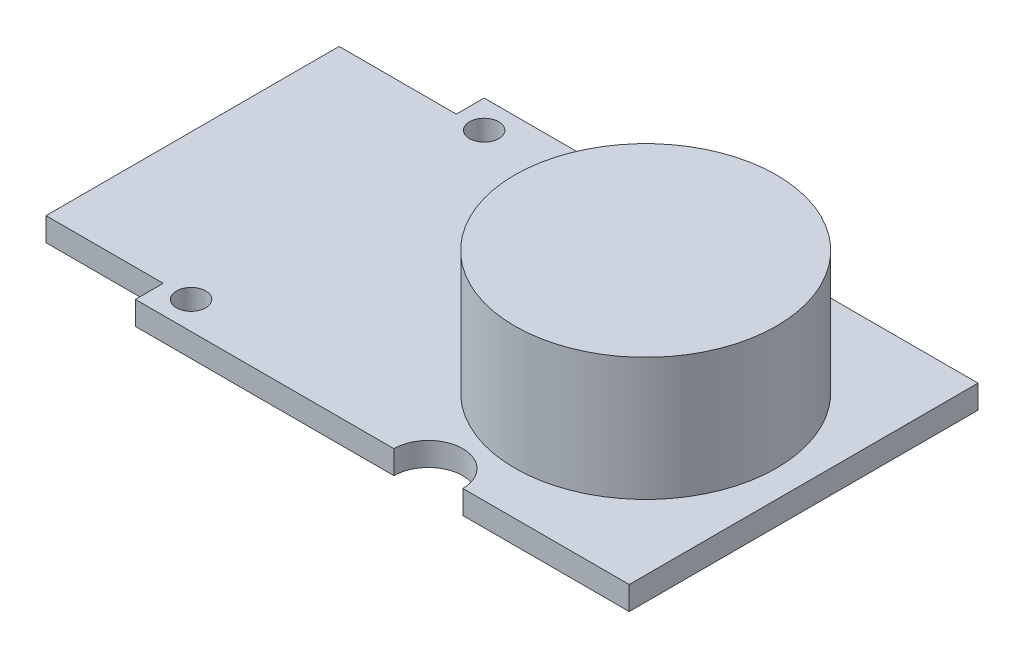
ISO-10303-21;
HEADER;
FILE_DESCRIPTION(('STEP AP214'),'2;1');
FILE_NAME('part.step','',(''),(''),'','','');
FILE_SCHEMA(('AUTOMOTIVE_DESIGN { 1 0 10303 214 1 1 1 1 }'));
ENDSEC;
DATA;
#1=APPLICATION_CONTEXT('core data for automotive mechanical design processes');
#2=APPLICATION_PROTOCOL_DEFINITION('international standard','automotive_design',2000,#1);
#3=PRODUCT_CONTEXT('',#1,'mechanical');
#4=PRODUCT('Part','Part','',(#3));
#5=PRODUCT_RELATED_PRODUCT_CATEGORY('part','',(#4));
#6=PRODUCT_DEFINITION_FORMATION('','',#4);
#7=PRODUCT_DEFINITION_CONTEXT('part definition',#1,'design');
#8=PRODUCT_DEFINITION('design','',#6,#7);
#9=PRODUCT_DEFINITION_SHAPE('','',#8);
#10=(LENGTH_UNIT() NAMED_UNIT(*) SI_UNIT(.MILLI.,.METRE.));
#11=(NAMED_UNIT(*) PLANE_ANGLE_UNIT() SI_UNIT($,.RADIAN.));
#12=(NAMED_UNIT(*) SI_UNIT($,.STERADIAN.) SOLID_ANGLE_UNIT());
#13=UNCERTAINTY_MEASURE_WITH_UNIT(LENGTH_MEASURE(1.E-05),#10,'distance_accuracy_value','');
#14=(GEOMETRIC_REPRESENTATION_CONTEXT(3) GLOBAL_UNCERTAINTY_ASSIGNED_CONTEXT((#13)) GLOBAL_UNIT_ASSIGNED_CONTEXT((#10,
#11,#12)) REPRESENTATION_CONTEXT('',''));
#15=CARTESIAN_POINT('',(0.,0.,0.));
#16=DIRECTION('',(0.,0.,1.));
#17=DIRECTION('',(1.,0.,0.));
#18=AXIS2_PLACEMENT_3D('',#15,#16,#17);
#19=CARTESIAN_POINT('',(0.,1.6,-11.9));
#20=DIRECTION('',(0.,0.,-1.));
#21=DIRECTION('',(-1.,0.,0.));
#22=AXIS2_PLACEMENT_3D('',#19,#20,#21);
#23=PLANE('',#22);
#24=DIRECTION('',(0.,1.,0.));
#25=VECTOR('',#24,1.);
#26=CARTESIAN_POINT('',(-22.9202394445578,0.,-11.9));
#27=LINE('',#26,#25);
#28=CARTESIAN_POINT('',(-22.9202394445578,0.,-11.9));
#29=VERTEX_POINT('',#28);
#30=CARTESIAN_POINT('',(-22.9202394445578,1.6,-11.9));
#31=VERTEX_POINT('',#30);
#32=EDGE_CURVE('E241',#29,#31,#27,.T.);
#33=ORIENTED_EDGE('',*,*,#32,.T.);
#34=DIRECTION('',(1.,0.,0.));
#35=VECTOR('',#34,1.);
#36=CARTESIAN_POINT('',(0.,1.6,-11.9));
#37=LINE('',#36,#35);
#38=CARTESIAN_POINT('',(-5.28010717467876,1.6,-11.9));
#39=VERTEX_POINT('',#38);
#40=EDGE_CURVE('E191',#31,#39,#37,.T.);
#41=ORIENTED_EDGE('',*,*,#40,.T.);
#42=DIRECTION('',(0.,-1.,0.));
#43=VECTOR('',#42,1.);
#44=CARTESIAN_POINT('',(-5.28010717467876,1.6,-11.9));
#45=LINE('',#44,#43);
#46=CARTESIAN_POINT('',(-5.28010717467876,0.,-11.9));
#47=VERTEX_POINT('',#46);
#48=EDGE_CURVE('E192',#39,#47,#45,.T.);
#49=ORIENTED_EDGE('',*,*,#48,.T.);
#50=DIRECTION('',(1.,0.,0.));
#51=VECTOR('',#50,1.);
#52=CARTESIAN_POINT('',(0.,0.,-11.9));
#53=LINE('',#52,#51);
#54=EDGE_CURVE('E160',#29,#47,#53,.T.);
#55=ORIENTED_EDGE('',*,*,#54,.F.);
#56=EDGE_LOOP('',(#33,#41,#49,#55));
#57=FACE_BOUND('',#56,.T.);
#58=ADVANCED_FACE('F44',(#57),#23,.T.);
#59=CARTESIAN_POINT('',(-30.9202394445578,1.6,0.));
#60=DIRECTION('',(1.,0.,0.));
#61=DIRECTION('',(0.,0.,-1.));
#62=AXIS2_PLACEMENT_3D('',#59,#60,#61);
#63=PLANE('',#62);
#64=DIRECTION('',(0.,0.,1.));
#65=VECTOR('',#64,1.);
#66=CARTESIAN_POINT('',(-30.9202394445578,1.6,0.));
#67=LINE('',#66,#65);
#68=CARTESIAN_POINT('',(-30.9202394445578,1.6,-10.));
#69=VERTEX_POINT('',#68);
#70=CARTESIAN_POINT('',(-30.9202394445578,1.6,10.));
#71=VERTEX_POINT('',#70);
#72=EDGE_CURVE('E152',#69,#71,#67,.T.);
#73=ORIENTED_EDGE('',*,*,#72,.F.);
#74=DIRECTION('',(0.,1.,0.));
#75=VECTOR('',#74,1.);
#76=CARTESIAN_POINT('',(-30.9202394445578,0.,-10.));
#77=LINE('',#76,#75);
#78=CARTESIAN_POINT('',(-30.9202394445578,0.,-10.));
#79=VERTEX_POINT('',#78);
#80=EDGE_CURVE('E138',#79,#69,#77,.T.);
#81=ORIENTED_EDGE('',*,*,#80,.F.);
#82=DIRECTION('',(0.,0.,1.));
#83=VECTOR('',#82,1.);
#84=CARTESIAN_POINT('',(-30.9202394445578,0.,0.));
#85=LINE('',#84,#83);
#86=CARTESIAN_POINT('',(-30.9202394445578,0.,10.));
#87=VERTEX_POINT('',#86);
#88=EDGE_CURVE('E150',#79,#87,#85,.T.);
#89=ORIENTED_EDGE('',*,*,#88,.T.);
#90=DIRECTION('',(0.,1.,0.));
#91=VECTOR('',#90,1.);
#92=CARTESIAN_POINT('',(-30.9202394445578,0.,10.));
#93=LINE('',#92,#91);
#94=EDGE_CURVE('E341',#87,#71,#93,.T.);
#95=ORIENTED_EDGE('',*,*,#94,.T.);
#96=EDGE_LOOP('',(#73,#81,#89,#95));
#97=FACE_BOUND('',#96,.T.);
#98=ADVANCED_FACE('F46',(#97),#63,.F.);
#99=CARTESIAN_POINT('',(0.,1.6,11.9));
#100=DIRECTION('',(0.,0.,-1.));
#101=DIRECTION('',(-1.,0.,0.));
#102=AXIS2_PLACEMENT_3D('',#99,#100,#101);
#103=PLANE('',#102);
#104=DIRECTION('',(1.,0.,0.));
#105=VECTOR('',#104,1.);
#106=CARTESIAN_POINT('',(0.,1.6,11.9));
#107=LINE('',#106,#105);
#108=CARTESIAN_POINT('',(-22.9202394445578,1.6,11.9));
#109=VERTEX_POINT('',#108);
#110=CARTESIAN_POINT('',(-5.28010717467876,1.6,11.9));
#111=VERTEX_POINT('',#110);
#112=EDGE_CURVE('E228',#109,#111,#107,.T.);
#113=ORIENTED_EDGE('',*,*,#112,.F.);
#114=DIRECTION('',(0.,1.,0.));
#115=VECTOR('',#114,1.);
#116=CARTESIAN_POINT('',(-22.9202394445578,0.,11.9));
#117=LINE('',#116,#115);
#118=CARTESIAN_POINT('',(-22.9202394445578,0.,11.9));
#119=VERTEX_POINT('',#118);
#120=EDGE_CURVE('E229',#119,#109,#117,.T.);
#121=ORIENTED_EDGE('',*,*,#120,.F.);
#122=DIRECTION('',(1.,0.,0.));
#123=VECTOR('',#122,1.);
#124=CARTESIAN_POINT('',(0.,0.,11.9));
#125=LINE('',#124,#123);
#126=CARTESIAN_POINT('',(-5.28010717467876,0.,11.9));
#127=VERTEX_POINT('',#126);
#128=EDGE_CURVE('E159',#119,#127,#125,.T.);
#129=ORIENTED_EDGE('',*,*,#128,.T.);
#130=DIRECTION('',(0.,-1.,0.));
#131=VECTOR('',#130,1.);
#132=CARTESIAN_POINT('',(-5.28010717467876,1.6,11.9));
#133=LINE('',#132,#131);
#134=EDGE_CURVE('E11',#111,#127,#133,.T.);
#135=ORIENTED_EDGE('',*,*,#134,.F.);
#136=EDGE_LOOP('',(#113,#121,#129,#135));
#137=FACE_BOUND('',#136,.T.);
#138=ADVANCED_FACE('F226',(#137),#103,.F.);
#139=CARTESIAN_POINT('',(-2.93010717467876,1.6,11.9));
#140=DIRECTION('',(0.,-1.,0.));
#141=DIRECTION('',(0.,0.,-1.));
#142=AXIS2_PLACEMENT_3D('',#139,#140,#141);
#143=CYLINDRICAL_SURFACE('',#142,2.35);
#144=CARTESIAN_POINT('',(-2.93010717467876,0.,11.9));
#145=DIRECTION('',(0.,1.,0.));
#146=DIRECTION('',(0.,0.,1.));
#147=AXIS2_PLACEMENT_3D('',#144,#145,#146);
#148=CIRCLE('',#147,2.35);
#149=CARTESIAN_POINT('',(-0.580107174678759,0.,11.9));
#150=VERTEX_POINT('',#149);
#151=EDGE_CURVE('E164',#150,#127,#148,.T.);
#152=ORIENTED_EDGE('',*,*,#151,.F.);
#153=DIRECTION('',(0.,-1.,0.));
#154=VECTOR('',#153,1.);
#155=CARTESIAN_POINT('',(-0.580107174678759,1.6,11.9));
#156=LINE('',#155,#154);
#157=CARTESIAN_POINT('',(-0.580107174678759,1.6,11.9));
#158=VERTEX_POINT('',#157);
#159=EDGE_CURVE('E53',#158,#150,#156,.T.);
#160=ORIENTED_EDGE('',*,*,#159,.F.);
#161=CARTESIAN_POINT('',(-2.93010717467876,1.6,11.9));
#162=DIRECTION('',(0.,1.,0.));
#163=DIRECTION('',(0.,0.,1.));
#164=AXIS2_PLACEMENT_3D('',#161,#162,#163);
#165=CIRCLE('',#164,2.35);
#166=EDGE_CURVE('E223',#158,#111,#165,.T.);
#167=ORIENTED_EDGE('',*,*,#166,.T.);
#168=ORIENTED_EDGE('',*,*,#134,.T.);
#169=EDGE_LOOP('',(#152,#160,#167,#168));
#170=FACE_BOUND('',#169,.T.);
#171=ADVANCED_FACE('F221',(#170),#143,.F.);
#172=CARTESIAN_POINT('',(10.7797605554422,0.,11.9));
#173=VERTEX_POINT('',#172);
#174=EDGE_CURVE('E166',#150,#173,#125,.T.);
#175=ORIENTED_EDGE('',*,*,#174,.T.);
#176=DIRECTION('',(0.,-1.,0.));
#177=VECTOR('',#176,1.);
#178=CARTESIAN_POINT('',(10.7797605554422,1.6,11.9));
#179=LINE('',#178,#177);
#180=CARTESIAN_POINT('',(10.7797605554422,1.6,11.9));
#181=VERTEX_POINT('',#180);
#182=EDGE_CURVE('E203',#181,#173,#179,.T.);
#183=ORIENTED_EDGE('',*,*,#182,.F.);
#184=EDGE_CURVE('E212',#158,#181,#107,.T.);
#185=ORIENTED_EDGE('',*,*,#184,.F.);
#186=ORIENTED_EDGE('',*,*,#159,.T.);
#187=EDGE_LOOP('',(#175,#183,#185,#186));
#188=FACE_BOUND('',#187,.T.);
#189=ADVANCED_FACE('F210',(#188),#103,.F.);
#190=CARTESIAN_POINT('',(10.7797605554422,1.6,0.));
#191=DIRECTION('',(1.,0.,0.));
#192=DIRECTION('',(0.,0.,-1.));
#193=AXIS2_PLACEMENT_3D('',#190,#191,#192);
#194=PLANE('',#193);
#195=DIRECTION('',(0.,0.,1.));
#196=VECTOR('',#195,1.);
#197=CARTESIAN_POINT('',(10.7797605554422,0.,0.));
#198=LINE('',#197,#196);
#199=CARTESIAN_POINT('',(10.7797605554422,0.,-11.9));
#200=VERTEX_POINT('',#199);
#201=EDGE_CURVE('E175',#200,#173,#198,.T.);
#202=ORIENTED_EDGE('',*,*,#201,.F.);
#203=DIRECTION('',(0.,-1.,0.));
#204=VECTOR('',#203,1.);
#205=CARTESIAN_POINT('',(10.7797605554422,1.6,-11.9));
#206=LINE('',#205,#204);
#207=CARTESIAN_POINT('',(10.7797605554422,1.6,-11.9));
#208=VERTEX_POINT('',#207);
#209=EDGE_CURVE('E200',#208,#200,#206,.T.);
#210=ORIENTED_EDGE('',*,*,#209,.F.);
#211=DIRECTION('',(0.,0.,1.));
#212=VECTOR('',#211,1.);
#213=CARTESIAN_POINT('',(10.7797605554422,1.6,0.));
#214=LINE('',#213,#212);
#215=EDGE_CURVE('E266',#208,#181,#214,.T.);
#216=ORIENTED_EDGE('',*,*,#215,.T.);
#217=ORIENTED_EDGE('',*,*,#182,.T.);
#218=EDGE_LOOP('',(#202,#210,#216,#217));
#219=FACE_BOUND('',#218,.T.);
#220=ADVANCED_FACE('F313',(#219),#194,.T.);
#221=CARTESIAN_POINT('',(-0.580107174678759,0.,-11.9));
#222=VERTEX_POINT('',#221);
#223=EDGE_CURVE('E169',#222,#200,#53,.T.);
#224=ORIENTED_EDGE('',*,*,#223,.F.);
#225=DIRECTION('',(0.,-1.,0.));
#226=VECTOR('',#225,1.);
#227=CARTESIAN_POINT('',(-0.580107174678759,1.6,-11.9));
#228=LINE('',#227,#226);
#229=CARTESIAN_POINT('',(-0.580107174678759,1.6,-11.9));
#230=VERTEX_POINT('',#229);
#231=EDGE_CURVE('E196',#230,#222,#228,.T.);
#232=ORIENTED_EDGE('',*,*,#231,.F.);
#233=EDGE_CURVE('E259',#230,#208,#37,.T.);
#234=ORIENTED_EDGE('',*,*,#233,.T.);
#235=ORIENTED_EDGE('',*,*,#209,.T.);
#236=EDGE_LOOP('',(#224,#232,#234,#235));
#237=FACE_BOUND('',#236,.T.);
#238=ADVANCED_FACE('F303',(#237),#23,.T.);
#239=CARTESIAN_POINT('',(-21.0202394445578,1.6,10.));
#240=DIRECTION('',(0.,-1.,0.));
#241=DIRECTION('',(0.,0.,-1.));
#242=AXIS2_PLACEMENT_3D('',#239,#240,#241);
#243=CYLINDRICAL_SURFACE('',#242,1.);
#244=CARTESIAN_POINT('',(-21.0202394445578,1.6,10.));
#245=DIRECTION('',(0.,1.,0.));
#246=DIRECTION('',(0.,0.,1.));
#247=AXIS2_PLACEMENT_3D('',#244,#245,#246);
#248=CIRCLE('',#247,1.);
#249=CARTESIAN_POINT('',(-21.0202394445578,1.6,11.));
#250=VERTEX_POINT('',#249);
#251=EDGE_CURVE('E274',#250,#250,#248,.T.);
#252=ORIENTED_EDGE('',*,*,#251,.T.);
#253=EDGE_LOOP('',(#252));
#254=FACE_BOUND('',#253,.T.);
#255=CARTESIAN_POINT('',(-21.0202394445578,0.,10.));
#256=DIRECTION('',(0.,1.,0.));
#257=DIRECTION('',(0.,0.,1.));
#258=AXIS2_PLACEMENT_3D('',#255,#256,#257);
#259=CIRCLE('',#258,1.);
#260=CARTESIAN_POINT('',(-21.0202394445578,0.,11.));
#261=VERTEX_POINT('',#260);
#262=EDGE_CURVE('E183',#261,#261,#259,.T.);
#263=ORIENTED_EDGE('',*,*,#262,.F.);
#264=EDGE_LOOP('',(#263));
#265=FACE_BOUND('',#264,.T.);
#266=ADVANCED_FACE('F312',(#254,#265),#243,.F.);
#267=CARTESIAN_POINT('',(-2.93010717467876,1.6,-11.9));
#268=DIRECTION('',(0.,-1.,0.));
#269=DIRECTION('',(0.,0.,-1.));
#270=AXIS2_PLACEMENT_3D('',#267,#268,#269);
#271=CYLINDRICAL_SURFACE('',#270,2.35);
#272=CARTESIAN_POINT('',(-2.93010717467876,0.,-11.9));
#273=DIRECTION('',(0.,1.,0.));
#274=DIRECTION('',(0.,0.,1.));
#275=AXIS2_PLACEMENT_3D('',#272,#273,#274);
#276=CIRCLE('',#275,2.35);
#277=EDGE_CURVE('E179',#47,#222,#276,.T.);
#278=ORIENTED_EDGE('',*,*,#277,.F.);
#279=ORIENTED_EDGE('',*,*,#48,.F.);
#280=CARTESIAN_POINT('',(-2.93010717467876,1.6,-11.9));
#281=DIRECTION('',(0.,1.,0.));
#282=DIRECTION('',(0.,0.,1.));
#283=AXIS2_PLACEMENT_3D('',#280,#281,#282);
#284=CIRCLE('',#283,2.35);
#285=EDGE_CURVE('E270',#39,#230,#284,.T.);
#286=ORIENTED_EDGE('',*,*,#285,.T.);
#287=ORIENTED_EDGE('',*,*,#231,.T.);
#288=EDGE_LOOP('',(#278,#279,#286,#287));
#289=FACE_BOUND('',#288,.T.);
#290=ADVANCED_FACE('F295',(#289),#271,.F.);
#291=CARTESIAN_POINT('',(-21.0202394445578,1.6,-10.));
#292=DIRECTION('',(0.,-1.,0.));
#293=DIRECTION('',(0.,0.,-1.));
#294=AXIS2_PLACEMENT_3D('',#291,#292,#293);
#295=CYLINDRICAL_SURFACE('',#294,1.);
#296=CARTESIAN_POINT('',(-21.0202394445578,1.6,-10.));
#297=DIRECTION('',(0.,1.,0.));
#298=DIRECTION('',(0.,0.,1.));
#299=AXIS2_PLACEMENT_3D('',#296,#297,#298);
#300=CIRCLE('',#299,1.);
#301=CARTESIAN_POINT('',(-21.0202394445578,1.6,-9.));
#302=VERTEX_POINT('',#301);
#303=EDGE_CURVE('E197',#302,#302,#300,.T.);
#304=ORIENTED_EDGE('',*,*,#303,.T.);
#305=EDGE_LOOP('',(#304));
#306=FACE_BOUND('',#305,.T.);
#307=CARTESIAN_POINT('',(-21.0202394445578,0.,-10.));
#308=DIRECTION('',(0.,1.,0.));
#309=DIRECTION('',(0.,0.,1.));
#310=AXIS2_PLACEMENT_3D('',#307,#308,#309);
#311=CIRCLE('',#310,1.);
#312=CARTESIAN_POINT('',(-21.0202394445578,0.,-9.));
#313=VERTEX_POINT('',#312);
#314=EDGE_CURVE('E187',#313,#313,#311,.T.);
#315=ORIENTED_EDGE('',*,*,#314,.F.);
#316=EDGE_LOOP('',(#315));
#317=FACE_BOUND('',#316,.T.);
#318=ADVANCED_FACE('F281',(#306,#317),#295,.F.);
#319=CARTESIAN_POINT('',(0.,1.6,0.));
#320=DIRECTION('',(0.,1.,0.));
#321=DIRECTION('',(0.,0.,1.));
#322=AXIS2_PLACEMENT_3D('',#319,#320,#321);
#323=PLANE('',#322);
#324=DIRECTION('',(0.,0.,-1.));
#325=VECTOR('',#324,1.);
#326=CARTESIAN_POINT('',(-22.9202394445578,1.6,0.));
#327=LINE('',#326,#325);
#328=CARTESIAN_POINT('',(-22.9202394445578,1.6,-10.));
#329=VERTEX_POINT('',#328);
#330=EDGE_CURVE('E247',#329,#31,#327,.T.);
#331=ORIENTED_EDGE('',*,*,#330,.F.);
#332=DIRECTION('',(1.,0.,0.));
#333=VECTOR('',#332,1.);
#334=CARTESIAN_POINT('',(0.,1.6,-10.));
#335=LINE('',#334,#333);
#336=EDGE_CURVE('E244',#69,#329,#335,.T.);
#337=ORIENTED_EDGE('',*,*,#336,.F.);
#338=ORIENTED_EDGE('',*,*,#72,.T.);
#339=DIRECTION('',(-1.,0.,0.));
#340=VECTOR('',#339,1.);
#341=CARTESIAN_POINT('',(0.,1.6,10.));
#342=LINE('',#341,#340);
#343=CARTESIAN_POINT('',(-22.9202394445578,1.6,10.));
#344=VERTEX_POINT('',#343);
#345=EDGE_CURVE('E240',#344,#71,#342,.T.);
#346=ORIENTED_EDGE('',*,*,#345,.F.);
#347=DIRECTION('',(0.,0.,-1.));
#348=VECTOR('',#347,1.);
#349=CARTESIAN_POINT('',(-22.9202394445578,1.6,0.));
#350=LINE('',#349,#348);
#351=EDGE_CURVE('E237',#109,#344,#350,.T.);
#352=ORIENTED_EDGE('',*,*,#351,.F.);
#353=ORIENTED_EDGE('',*,*,#112,.T.);
#354=ORIENTED_EDGE('',*,*,#166,.F.);
#355=ORIENTED_EDGE('',*,*,#184,.T.);
#356=ORIENTED_EDGE('',*,*,#215,.F.);
#357=ORIENTED_EDGE('',*,*,#233,.F.);
#358=ORIENTED_EDGE('',*,*,#285,.F.);
#359=ORIENTED_EDGE('',*,*,#40,.F.);
#360=EDGE_LOOP('',(#331,#337,#338,#346,#352,#353,#354,#355,#356,#357,#358,#359));
#361=FACE_BOUND('',#360,.T.);
#362=CARTESIAN_POINT('',(0.,1.6,0.));
#363=DIRECTION('',(0.,1.,0.));
#364=DIRECTION('',(0.,0.,1.));
#365=AXIS2_PLACEMENT_3D('',#362,#363,#364);
#366=CIRCLE('',#365,8.93136199618955);
#367=CARTESIAN_POINT('',(0.,1.6,8.93136199618955));
#368=VERTEX_POINT('',#367);
#369=EDGE_CURVE('E250',#368,#368,#366,.T.);
#370=ORIENTED_EDGE('',*,*,#369,.F.);
#371=EDGE_LOOP('',(#370));
#372=FACE_BOUND('',#371,.T.);
#373=ORIENTED_EDGE('',*,*,#251,.F.);
#374=EDGE_LOOP('',(#373));
#375=FACE_BOUND('',#374,.T.);
#376=ORIENTED_EDGE('',*,*,#303,.F.);
#377=EDGE_LOOP('',(#376));
#378=FACE_BOUND('',#377,.T.);
#379=ADVANCED_FACE('F284',(#361,#372,#375,#378),#323,.T.);
#380=CARTESIAN_POINT('',(0.,0.,0.));
#381=DIRECTION('',(0.,1.,0.));
#382=DIRECTION('',(0.,0.,1.));
#383=AXIS2_PLACEMENT_3D('',#380,#381,#382);
#384=PLANE('',#383);
#385=DIRECTION('',(1.,0.,0.));
#386=VECTOR('',#385,1.);
#387=CARTESIAN_POINT('',(-30.9202394445578,0.,-10.));
#388=LINE('',#387,#386);
#389=CARTESIAN_POINT('',(-22.9202394445578,0.,-10.));
#390=VERTEX_POINT('',#389);
#391=EDGE_CURVE('E135',#79,#390,#388,.T.);
#392=ORIENTED_EDGE('',*,*,#391,.T.);
#393=DIRECTION('',(0.,0.,-1.));
#394=VECTOR('',#393,1.);
#395=CARTESIAN_POINT('',(-22.9202394445578,0.,-11.9));
#396=LINE('',#395,#394);
#397=EDGE_CURVE('E60',#390,#29,#396,.T.);
#398=ORIENTED_EDGE('',*,*,#397,.T.);
#399=ORIENTED_EDGE('',*,*,#54,.T.);
#400=ORIENTED_EDGE('',*,*,#277,.T.);
#401=ORIENTED_EDGE('',*,*,#223,.T.);
#402=ORIENTED_EDGE('',*,*,#201,.T.);
#403=ORIENTED_EDGE('',*,*,#174,.F.);
#404=ORIENTED_EDGE('',*,*,#151,.T.);
#405=ORIENTED_EDGE('',*,*,#128,.F.);
#406=DIRECTION('',(0.,0.,-1.));
#407=VECTOR('',#406,1.);
#408=CARTESIAN_POINT('',(-22.9202394445578,0.,11.9));
#409=LINE('',#408,#407);
#410=CARTESIAN_POINT('',(-22.9202394445578,0.,10.));
#411=VERTEX_POINT('',#410);
#412=EDGE_CURVE('E144',#119,#411,#409,.T.);
#413=ORIENTED_EDGE('',*,*,#412,.T.);
#414=DIRECTION('',(-1.,0.,0.));
#415=VECTOR('',#414,1.);
#416=CARTESIAN_POINT('',(-30.9202394445578,0.,10.));
#417=LINE('',#416,#415);
#418=EDGE_CURVE('E68',#411,#87,#417,.T.);
#419=ORIENTED_EDGE('',*,*,#418,.T.);
#420=ORIENTED_EDGE('',*,*,#88,.F.);
#421=EDGE_LOOP('',(#392,#398,#399,#400,#401,#402,#403,#404,#405,#413,#419,#420));
#422=FACE_BOUND('',#421,.T.);
#423=ORIENTED_EDGE('',*,*,#262,.T.);
#424=EDGE_LOOP('',(#423));
#425=FACE_BOUND('',#424,.T.);
#426=ORIENTED_EDGE('',*,*,#314,.T.);
#427=EDGE_LOOP('',(#426));
#428=FACE_BOUND('',#427,.T.);
#429=ADVANCED_FACE('F155',(#422,#425,#428),#384,.F.);
#430=CARTESIAN_POINT('',(0.,10.,0.));
#431=DIRECTION('',(0.,-1.,0.));
#432=DIRECTION('',(0.,0.,-1.));
#433=AXIS2_PLACEMENT_3D('',#430,#431,#432);
#434=CYLINDRICAL_SURFACE('',#433,8.93136199618955);
#435=CARTESIAN_POINT('',(0.,10.,0.));
#436=DIRECTION('',(0.,1.,0.));
#437=DIRECTION('',(0.,0.,1.));
#438=AXIS2_PLACEMENT_3D('',#435,#436,#437);
#439=CIRCLE('',#438,8.93136199618955);
#440=CARTESIAN_POINT('',(0.,10.,8.93136199618955));
#441=VERTEX_POINT('',#440);
#442=EDGE_CURVE('E167',#441,#441,#439,.T.);
#443=ORIENTED_EDGE('',*,*,#442,.F.);
#444=EDGE_LOOP('',(#443));
#445=FACE_BOUND('',#444,.T.);
#446=ORIENTED_EDGE('',*,*,#369,.T.);
#447=EDGE_LOOP('',(#446));
#448=FACE_BOUND('',#447,.T.);
#449=ADVANCED_FACE('F292',(#445,#448),#434,.T.);
#450=CARTESIAN_POINT('',(0.,10.,0.));
#451=DIRECTION('',(0.,1.,0.));
#452=DIRECTION('',(0.,0.,1.));
#453=AXIS2_PLACEMENT_3D('',#450,#451,#452);
#454=PLANE('',#453);
#455=ORIENTED_EDGE('',*,*,#442,.T.);
#456=EDGE_LOOP('',(#455));
#457=FACE_BOUND('',#456,.T.);
#458=ADVANCED_FACE('F364',(#457),#454,.T.);
#459=CARTESIAN_POINT('',(-30.9202394445578,0.,10.));
#460=DIRECTION('',(0.,0.,-1.));
#461=DIRECTION('',(-1.,0.,0.));
#462=AXIS2_PLACEMENT_3D('',#459,#460,#461);
#463=PLANE('',#462);
#464=ORIENTED_EDGE('',*,*,#345,.T.);
#465=ORIENTED_EDGE('',*,*,#94,.F.);
#466=ORIENTED_EDGE('',*,*,#418,.F.);
#467=DIRECTION('',(0.,1.,0.));
#468=VECTOR('',#467,1.);
#469=CARTESIAN_POINT('',(-22.9202394445578,0.,10.));
#470=LINE('',#469,#468);
#471=EDGE_CURVE('E338',#411,#344,#470,.T.);
#472=ORIENTED_EDGE('',*,*,#471,.T.);
#473=EDGE_LOOP('',(#464,#465,#466,#472));
#474=FACE_BOUND('',#473,.T.);
#475=ADVANCED_FACE('F339',(#474),#463,.F.);
#476=CARTESIAN_POINT('',(-22.9202394445578,0.,11.9));
#477=DIRECTION('',(1.,0.,0.));
#478=DIRECTION('',(0.,0.,-1.));
#479=AXIS2_PLACEMENT_3D('',#476,#477,#478);
#480=PLANE('',#479);
#481=ORIENTED_EDGE('',*,*,#351,.T.);
#482=ORIENTED_EDGE('',*,*,#471,.F.);
#483=ORIENTED_EDGE('',*,*,#412,.F.);
#484=ORIENTED_EDGE('',*,*,#120,.T.);
#485=EDGE_LOOP('',(#481,#482,#483,#484));
#486=FACE_BOUND('',#485,.T.);
#487=ADVANCED_FACE('F337',(#486),#480,.F.);
#488=CARTESIAN_POINT('',(-22.9202394445578,0.,-11.9));
#489=DIRECTION('',(1.,0.,0.));
#490=DIRECTION('',(0.,0.,-1.));
#491=AXIS2_PLACEMENT_3D('',#488,#489,#490);
#492=PLANE('',#491);
#493=ORIENTED_EDGE('',*,*,#330,.T.);
#494=ORIENTED_EDGE('',*,*,#32,.F.);
#495=ORIENTED_EDGE('',*,*,#397,.F.);
#496=DIRECTION('',(0.,1.,0.));
#497=VECTOR('',#496,1.);
#498=CARTESIAN_POINT('',(-22.9202394445578,0.,-10.));
#499=LINE('',#498,#497);
#500=EDGE_CURVE('E140',#390,#329,#499,.T.);
#501=ORIENTED_EDGE('',*,*,#500,.T.);
#502=EDGE_LOOP('',(#493,#494,#495,#501));
#503=FACE_BOUND('',#502,.T.);
#504=ADVANCED_FACE('F352',(#503),#492,.F.);
#505=CARTESIAN_POINT('',(-30.9202394445578,0.,-10.));
#506=DIRECTION('',(0.,0.,1.));
#507=DIRECTION('',(1.,0.,0.));
#508=AXIS2_PLACEMENT_3D('',#505,#506,#507);
#509=PLANE('',#508);
#510=ORIENTED_EDGE('',*,*,#336,.T.);
#511=ORIENTED_EDGE('',*,*,#500,.F.);
#512=ORIENTED_EDGE('',*,*,#391,.F.);
#513=ORIENTED_EDGE('',*,*,#80,.T.);
#514=EDGE_LOOP('',(#510,#511,#512,#513));
#515=FACE_BOUND('',#514,.T.);
#516=ADVANCED_FACE('F137',(#515),#509,.F.);
#517=CLOSED_SHELL('',(#58,#98,#138,#171,#189,#220,#238,#266,#290,#318,#379,#429,#449,#458,#475,
#487,#504,#516));
#518=MANIFOLD_SOLID_BREP('B2',#517);
#519=ADVANCED_BREP_SHAPE_REPRESENTATION('',(#18,#518),#14);
#520=SHAPE_DEFINITION_REPRESENTATION(#9,#519);
ENDSEC;
END-ISO-10303-21;
